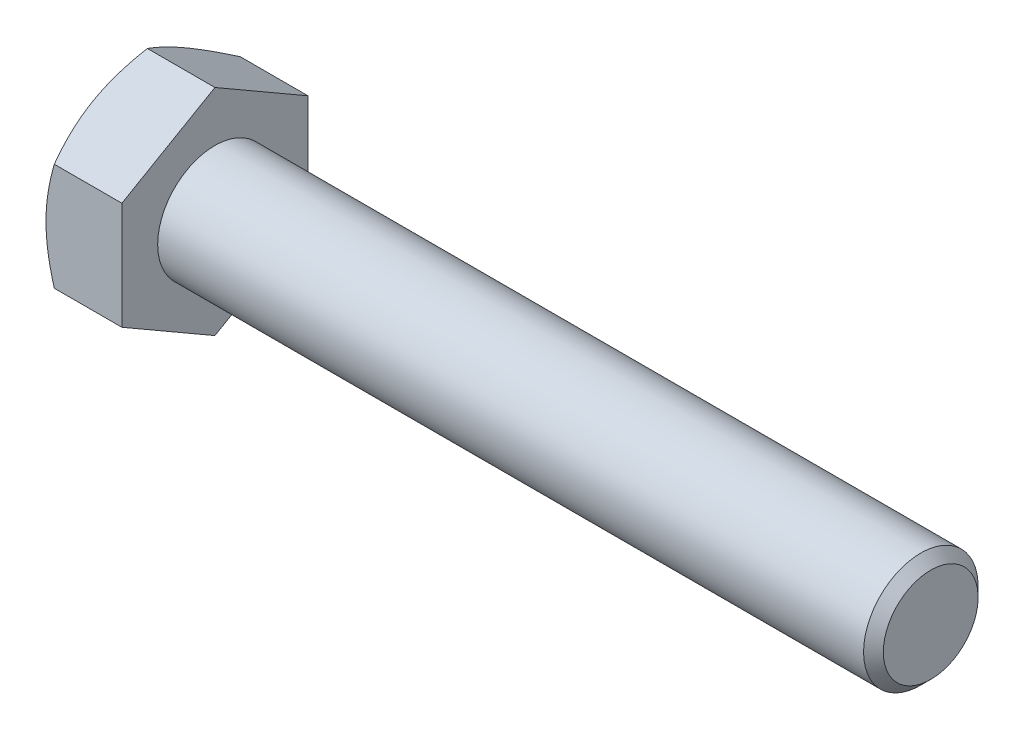
ISO-10303-21;
HEADER;
FILE_DESCRIPTION(('STEP AP214'),'2;1');
FILE_NAME('part.step','',(''),(''),'','','');
FILE_SCHEMA(('AUTOMOTIVE_DESIGN { 1 0 10303 214 1 1 1 1 }'));
ENDSEC;
DATA;
#1=APPLICATION_CONTEXT('core data for automotive mechanical design processes');
#2=APPLICATION_PROTOCOL_DEFINITION('international standard','automotive_design',2000,#1);
#3=PRODUCT_CONTEXT('',#1,'mechanical');
#4=PRODUCT('Part','Part','',(#3));
#5=PRODUCT_RELATED_PRODUCT_CATEGORY('part','',(#4));
#6=PRODUCT_DEFINITION_FORMATION('','',#4);
#7=PRODUCT_DEFINITION_CONTEXT('part definition',#1,'design');
#8=PRODUCT_DEFINITION('design','',#6,#7);
#9=PRODUCT_DEFINITION_SHAPE('','',#8);
#10=(LENGTH_UNIT() NAMED_UNIT(*) SI_UNIT(.MILLI.,.METRE.));
#11=(NAMED_UNIT(*) PLANE_ANGLE_UNIT() SI_UNIT($,.RADIAN.));
#12=(NAMED_UNIT(*) SI_UNIT($,.STERADIAN.) SOLID_ANGLE_UNIT());
#13=UNCERTAINTY_MEASURE_WITH_UNIT(LENGTH_MEASURE(1.E-05),#10,'distance_accuracy_value','');
#14=(GEOMETRIC_REPRESENTATION_CONTEXT(3) GLOBAL_UNCERTAINTY_ASSIGNED_CONTEXT((#13)) GLOBAL_UNIT_ASSIGNED_CONTEXT((#10,
#11,#12)) REPRESENTATION_CONTEXT('',''));
#15=CARTESIAN_POINT('',(0.,0.,0.));
#16=DIRECTION('',(0.,0.,1.));
#17=DIRECTION('',(1.,0.,0.));
#18=AXIS2_PLACEMENT_3D('',#15,#16,#17);
#19=CARTESIAN_POINT('',(0.,7.50555349946514,0.));
#20=DIRECTION('',(1.,0.,0.));
#21=DIRECTION('',(0.,0.,-1.));
#22=AXIS2_PLACEMENT_3D('',#19,#20,#21);
#23=PLANE('',#22);
#24=CARTESIAN_POINT('',(0.,0.,0.));
#25=DIRECTION('',(1.,0.,0.));
#26=DIRECTION('',(0.,0.,-1.));
#27=AXIS2_PLACEMENT_3D('',#24,#25,#26);
#28=CIRCLE('',#27,6.49999999995998);
#29=CARTESIAN_POINT('',(1.15555477460892E-11,-5.62916512458153,-3.24999999999));
#30=VERTEX_POINT('',#29);
#31=CARTESIAN_POINT('',(1.1552457738841E-11,0.,-6.49999999997999));
#32=VERTEX_POINT('',#31);
#33=EDGE_CURVE('E339',#30,#32,#28,.T.);
#34=ORIENTED_EDGE('',*,*,#33,.F.);
#35=CARTESIAN_POINT('',(0.,0.,0.));
#36=DIRECTION('',(1.,0.,0.));
#37=DIRECTION('',(0.,0.,-1.));
#38=AXIS2_PLACEMENT_3D('',#35,#36,#37);
#39=CIRCLE('',#38,6.49999999995998);
#40=CARTESIAN_POINT('',(1.15550411053332E-11,-5.62916512458152,3.24999999999001));
#41=VERTEX_POINT('',#40);
#42=EDGE_CURVE('E338',#41,#30,#39,.T.);
#43=ORIENTED_EDGE('',*,*,#42,.F.);
#44=CARTESIAN_POINT('',(0.,0.,0.));
#45=DIRECTION('',(1.,0.,0.));
#46=DIRECTION('',(0.,0.,-1.));
#47=AXIS2_PLACEMENT_3D('',#44,#45,#46);
#48=CIRCLE('',#47,6.49999999995998);
#49=CARTESIAN_POINT('',(1.15521679258111E-11,0.,6.49999999997999));
#50=VERTEX_POINT('',#49);
#51=EDGE_CURVE('E88',#50,#41,#48,.T.);
#52=ORIENTED_EDGE('',*,*,#51,.F.);
#53=CARTESIAN_POINT('',(0.,0.,0.));
#54=DIRECTION('',(1.,0.,0.));
#55=DIRECTION('',(0.,0.,-1.));
#56=AXIS2_PLACEMENT_3D('',#53,#54,#55);
#57=CIRCLE('',#56,6.49999999995998);
#58=CARTESIAN_POINT('',(1.15524765323843E-11,5.62916512458152,3.24999999999));
#59=VERTEX_POINT('',#58);
#60=EDGE_CURVE('E86',#59,#50,#57,.T.);
#61=ORIENTED_EDGE('',*,*,#60,.F.);
#62=CARTESIAN_POINT('',(0.,0.,0.));
#63=DIRECTION('',(1.,0.,0.));
#64=DIRECTION('',(0.,0.,-1.));
#65=AXIS2_PLACEMENT_3D('',#62,#63,#64);
#66=CIRCLE('',#65,6.49999999995998);
#67=CARTESIAN_POINT('',(1.15520344122427E-11,5.62916512458152,-3.24999999999));
#68=VERTEX_POINT('',#67);
#69=EDGE_CURVE('E19',#68,#59,#66,.T.);
#70=ORIENTED_EDGE('',*,*,#69,.F.);
#71=CARTESIAN_POINT('',(0.,0.,0.));
#72=DIRECTION('',(1.,0.,0.));
#73=DIRECTION('',(0.,0.,-1.));
#74=AXIS2_PLACEMENT_3D('',#71,#72,#73);
#75=CIRCLE('',#74,6.49999999995998);
#76=EDGE_CURVE('E264',#32,#68,#75,.T.);
#77=ORIENTED_EDGE('',*,*,#76,.F.);
#78=EDGE_LOOP('',(#34,#43,#52,#61,#70,#77));
#79=FACE_BOUND('',#78,.T.);
#80=ADVANCED_FACE('F16',(#79),#23,.F.);
#81=CARTESIAN_POINT('',(0.584039923126056,0.,0.));
#82=DIRECTION('',(1.,0.,0.));
#83=DIRECTION('',(0.,0.,-1.));
#84=AXIS2_PLACEMENT_3D('',#81,#82,#83);
#85=CONICAL_SURFACE('',#84,7.51158682049891,1.047197551212);
#86=CARTESIAN_POINT('',(0.580556583603038,7.50555349946481,-5.68456481556597E-13));
#87=CARTESIAN_POINT('',(0.492351589092373,7.35281628523265,-0.26454861525721));
#88=CARTESIAN_POINT('',(0.411540414604503,7.19885589650209,-0.531215830891591));
#89=CARTESIAN_POINT('',(0.269031363386546,6.88957797343578,-1.06690090730181));
#90=CARTESIAN_POINT('',(0.207238975555895,6.73427122699289,-1.33590008289911));
#91=CARTESIAN_POINT('',(0.131368414291871,6.49984538856281,-1.74193754566694));
#92=CARTESIAN_POINT('',(0.108872020464256,6.42140731241997,-1.8777962787943));
#93=CARTESIAN_POINT('',(0.0699302938009757,6.264155645091,-2.15016415618299));
#94=CARTESIAN_POINT('',(0.0534848017009781,6.18534206384378,-2.28667328322963));
#95=CARTESIAN_POINT('',(0.0269338255085263,6.02704786462284,-2.56084687882373));
#96=CARTESIAN_POINT('',(0.0168605830574699,5.94756588426557,-2.69851370708872));
#97=CARTESIAN_POINT('',(0.00337972763244669,5.78844560823805,-2.97411810968276));
#98=CARTESIAN_POINT('',(-2.65652346789022E-05,5.70880728473494,-3.11205573221976));
#99=CARTESIAN_POINT('',(2.31040688244853E-11,5.62916512459895,-3.24999999999983));
#100=B_SPLINE_CURVE_WITH_KNOTS('',3,(#86,#87,#88,#89,#90,#91,#92,#93,#94,#95,#96,#97,#98,#99),
.UNSPECIFIED.,.F.,.F.,(4,2,2,2,2,2,4),(0.,0.954247655906537,1.9036737621373,2.37900973801286,
2.85433320178906,3.332042816259,3.80984701130876),.UNSPECIFIED.);
#101=CARTESIAN_POINT('',(0.580556583603038,7.50555349946481,0.));
#102=VERTEX_POINT('',#101);
#103=EDGE_CURVE('E98',#102,#68,#100,.T.);
#104=ORIENTED_EDGE('',*,*,#103,.T.);
#105=ORIENTED_EDGE('',*,*,#69,.T.);
#106=CARTESIAN_POINT('',(2.38262969880455E-11,5.62916512459777,3.24999999999938));
#107=CARTESIAN_POINT('',(-2.65652344219582E-05,5.70880728473446,3.11205573221969));
#108=CARTESIAN_POINT('',(0.00337972763251203,5.78844560823787,2.97411810968284));
#109=CARTESIAN_POINT('',(0.016860583057394,5.94756588426561,2.69851370708889));
#110=CARTESIAN_POINT('',(0.0269338255085004,6.02704786462282,2.56084687882384));
#111=CARTESIAN_POINT('',(0.0534848017009882,6.18534206384371,2.28667328322969));
#112=CARTESIAN_POINT('',(0.0699302938009718,6.26415564509096,2.15016415618305));
#113=CARTESIAN_POINT('',(0.108872020464242,6.42140731241995,1.87779627879436));
#114=CARTESIAN_POINT('',(0.131368414291862,6.49984538856279,1.74193754566698));
#115=CARTESIAN_POINT('',(0.207238975555892,6.73427122699287,1.33590008289914));
#116=CARTESIAN_POINT('',(0.269031363386541,6.88957797343576,1.06690090730184));
#117=CARTESIAN_POINT('',(0.411540414604495,7.19885589650208,0.531215830891611));
#118=CARTESIAN_POINT('',(0.492351589092366,7.35281628523265,0.264548615257222));
#119=CARTESIAN_POINT('',(0.580556583603039,7.50555349946481,5.67774003086218E-13));
#120=B_SPLINE_CURVE_WITH_KNOTS('',3,(#106,#107,#108,#109,#110,#111,#112,#113,#114,#115,#116,
#117,#118,#119),.UNSPECIFIED.,.F.,.F.,(4,2,2,2,2,2,4),(0.,0.477804195049821,0.955513809519796,
1.43083727329602,1.90617324917161,2.85559935540238,3.80984701130895),.UNSPECIFIED.);
#121=EDGE_CURVE('E96',#59,#102,#120,.T.);
#122=ORIENTED_EDGE('',*,*,#121,.T.);
#123=EDGE_LOOP('',(#104,#105,#122));
#124=FACE_BOUND('',#123,.T.);
#125=ADVANCED_FACE('F94',(#124),#85,.T.);
#126=CARTESIAN_POINT('',(0.584039923126056,0.,0.));
#127=DIRECTION('',(1.,0.,0.));
#128=DIRECTION('',(0.,0.,-1.));
#129=AXIS2_PLACEMENT_3D('',#126,#127,#128);
#130=CONICAL_SURFACE('',#129,7.51158682049891,1.047197551212);
#131=CARTESIAN_POINT('',(0.580556583603035,3.75277674973289,6.49999999999943));
#132=CARTESIAN_POINT('',(0.49235158909237,3.90551396396506,6.23545138474279));
#133=CARTESIAN_POINT('',(0.411540414604501,4.05947435269561,5.96878416910841));
#134=CARTESIAN_POINT('',(0.269031363386546,4.36875227576192,5.4330990926982));
#135=CARTESIAN_POINT('',(0.207238975555895,4.5240590222048,5.1640999171009));
#136=CARTESIAN_POINT('',(0.131368414291871,4.75848486063488,4.75806245433307));
#137=CARTESIAN_POINT('',(0.108872020464256,4.83692293677773,4.62220372120571));
#138=CARTESIAN_POINT('',(0.0699302938009757,4.99417460410669,4.34983584381702));
#139=CARTESIAN_POINT('',(0.0534848017009788,5.07298818535391,4.21332671677038));
#140=CARTESIAN_POINT('',(0.0269338255085272,5.23128238457485,3.93915312117628));
#141=CARTESIAN_POINT('',(0.0168605830574704,5.31076436493213,3.80148629291129));
#142=CARTESIAN_POINT('',(0.00337972763244649,5.46988464095964,3.52588189031725));
#143=CARTESIAN_POINT('',(-2.6565234679261E-05,5.54952296446275,3.38794426778026));
#144=CARTESIAN_POINT('',(2.31044109636824E-11,5.62916512459874,3.25000000000019));
#145=B_SPLINE_CURVE_WITH_KNOTS('',3,(#131,#132,#133,#134,#135,#136,#137,#138,#139,#140,#141,
#142,#143,#144),.UNSPECIFIED.,.F.,.F.,(4,2,2,2,2,2,4),(0.,0.954247655906532,1.90367376213729,
2.37900973801285,2.85433320178905,3.33204281625899,3.80984701130875),.UNSPECIFIED.);
#146=CARTESIAN_POINT('',(0.580556583603035,3.7527767497324,6.49999999999972));
#147=VERTEX_POINT('',#146);
#148=EDGE_CURVE('E101',#147,#59,#145,.T.);
#149=ORIENTED_EDGE('',*,*,#148,.T.);
#150=ORIENTED_EDGE('',*,*,#60,.T.);
#151=CARTESIAN_POINT('',(2.38266512998069E-11,0.,6.49999999999875));
#152=CARTESIAN_POINT('',(-2.65652344227332E-05,0.159284320272008,6.49999999999955));
#153=CARTESIAN_POINT('',(0.0033797276325113,0.31856096727825,6.49999999999988));
#154=CARTESIAN_POINT('',(0.0168605830573939,0.636801519333313,6.50000000000012));
#155=CARTESIAN_POINT('',(0.0269338255085009,0.795765480047878,6.50000000000003));
#156=CARTESIAN_POINT('',(0.0534848017009887,1.11235387848978,6.49999999999997));
#157=CARTESIAN_POINT('',(0.0699302938009717,1.26998104098423,6.49999999999999));
#158=CARTESIAN_POINT('',(0.108872020464242,1.58448437564217,6.50000000000001));
#159=CARTESIAN_POINT('',(0.131368414291861,1.74136052792787,6.5));
#160=CARTESIAN_POINT('',(0.207238975555891,2.21021220478804,6.49999999999999));
#161=CARTESIAN_POINT('',(0.26903136338654,2.52082569767382,6.5));
#162=CARTESIAN_POINT('',(0.411540414604493,3.13938154380644,6.5));
#163=CARTESIAN_POINT('',(0.492351589092363,3.44730232126757,6.50000000000001));
#164=CARTESIAN_POINT('',(0.580556583603035,3.75277674973191,6.5));
#165=B_SPLINE_CURVE_WITH_KNOTS('',3,(#151,#152,#153,#154,#155,#156,#157,#158,#159,#160,#161,
#162,#163,#164),.UNSPECIFIED.,.F.,.F.,(4,2,2,2,2,2,4),(0.,0.477804195049819,0.955513809519793,
1.43083727329602,1.90617324917161,2.85559935540237,3.80984701130894),.UNSPECIFIED.);
#166=EDGE_CURVE('E104',#50,#147,#165,.T.);
#167=ORIENTED_EDGE('',*,*,#166,.T.);
#168=EDGE_LOOP('',(#149,#150,#167));
#169=FACE_BOUND('',#168,.T.);
#170=ADVANCED_FACE('F102',(#169),#130,.T.);
#171=CARTESIAN_POINT('',(0.584039923126056,0.,0.));
#172=DIRECTION('',(1.,0.,0.));
#173=DIRECTION('',(0.,0.,-1.));
#174=AXIS2_PLACEMENT_3D('',#171,#172,#173);
#175=CONICAL_SURFACE('',#174,7.51158682049891,1.047197551212);
#176=ORIENTED_EDGE('',*,*,#51,.T.);
#177=CARTESIAN_POINT('',(2.38331262092634E-11,-5.62916512459777,3.24999999999939));
#178=CARTESIAN_POINT('',(-2.65652344164461E-05,-5.54952296446246,3.38794426777988));
#179=CARTESIAN_POINT('',(0.0033797276325173,-5.46988464095963,3.52588189031706));
#180=CARTESIAN_POINT('',(0.0168605830573994,-5.3107643649323,3.80148629291125));
#181=CARTESIAN_POINT('',(0.0269338255085061,-5.23128238457494,3.93915312117621));
#182=CARTESIAN_POINT('',(0.0534848017009937,-5.07298818535394,4.21332671677029));
#183=CARTESIAN_POINT('',(0.0699302938009766,-4.99417460410673,4.34983584381695));
#184=CARTESIAN_POINT('',(0.108872020464246,-4.83692293677778,4.62220372120566));
#185=CARTESIAN_POINT('',(0.131368414291866,-4.75848486063492,4.75806245433303));
#186=CARTESIAN_POINT('',(0.207238975555896,-4.52405902220483,5.16409991710086));
#187=CARTESIAN_POINT('',(0.269031363386544,-4.36875227576194,5.43309909269816));
#188=CARTESIAN_POINT('',(0.411540414604496,-4.05947435269564,5.96878416910839));
#189=CARTESIAN_POINT('',(0.492351589092366,-3.90551396396508,6.23545138474278));
#190=CARTESIAN_POINT('',(0.580556583603037,-3.7527767497329,6.49999999999943));
#191=B_SPLINE_CURVE_WITH_KNOTS('',3,(#177,#178,#179,#180,#181,#182,#183,#184,#185,#186,#187,
#188,#189,#190),.UNSPECIFIED.,.F.,.F.,(4,2,2,2,2,2,4),(0.,0.477804195049818,0.955513809519791,
1.43083727329601,1.9061732491716,2.85559935540236,3.80984701130893),.UNSPECIFIED.);
#192=CARTESIAN_POINT('',(0.580556583603037,-3.75277674973241,6.49999999999971));
#193=VERTEX_POINT('',#192);
#194=EDGE_CURVE('E179',#41,#193,#191,.T.);
#195=ORIENTED_EDGE('',*,*,#194,.T.);
#196=CARTESIAN_POINT('',(0.580556583603038,-3.75277674973192,6.5));
#197=CARTESIAN_POINT('',(0.492351589092373,-3.44730232126759,6.5));
#198=CARTESIAN_POINT('',(0.411540414604503,-3.13938154380647,6.5));
#199=CARTESIAN_POINT('',(0.269031363386547,-2.52082569767387,6.5));
#200=CARTESIAN_POINT('',(0.207238975555896,-2.21021220478809,6.5));
#201=CARTESIAN_POINT('',(0.131368414291872,-1.74136052792793,6.5));
#202=CARTESIAN_POINT('',(0.108872020464256,-1.58448437564224,6.5));
#203=CARTESIAN_POINT('',(0.069930293800976,-1.26998104098431,6.5));
#204=CARTESIAN_POINT('',(0.0534848017009787,-1.11235387848987,6.5));
#205=CARTESIAN_POINT('',(0.026933825508527,-0.795765480047989,6.5));
#206=CARTESIAN_POINT('',(0.0168605830574705,-0.636801519333436,6.5));
#207=CARTESIAN_POINT('',(0.00337972763244701,-0.318560967278408,6.5));
#208=CARTESIAN_POINT('',(-2.65652346786707E-05,-0.159284320272188,6.5));
#209=CARTESIAN_POINT('',(2.31044610445054E-11,-2.08059797367535E-13,6.5));
#210=B_SPLINE_CURVE_WITH_KNOTS('',3,(#196,#197,#198,#199,#200,#201,#202,#203,#204,#205,#206,
#207,#208,#209),.UNSPECIFIED.,.F.,.F.,(4,2,2,2,2,2,4),(0.,0.954247655906535,1.9036737621373,
2.37900973801286,2.85433320178906,3.33204281625899,3.80984701130876),.UNSPECIFIED.);
#211=EDGE_CURVE('E151',#193,#50,#210,.T.);
#212=ORIENTED_EDGE('',*,*,#211,.T.);
#213=EDGE_LOOP('',(#176,#195,#212));
#214=FACE_BOUND('',#213,.T.);
#215=ADVANCED_FACE('F141',(#214),#175,.T.);
#216=CARTESIAN_POINT('',(0.584039923126056,0.,0.));
#217=DIRECTION('',(1.,0.,0.));
#218=DIRECTION('',(0.,0.,-1.));
#219=AXIS2_PLACEMENT_3D('',#216,#217,#218);
#220=CONICAL_SURFACE('',#219,7.51158682049891,1.047197551212);
#221=ORIENTED_EDGE('',*,*,#42,.T.);
#222=CARTESIAN_POINT('',(2.38342887376555E-11,-5.62916512459777,-3.24999999999938));
#223=CARTESIAN_POINT('',(-2.65652344147577E-05,-5.70880728473447,-3.11205573221969));
#224=CARTESIAN_POINT('',(0.00337972763251886,-5.78844560823788,-2.97411810968284));
#225=CARTESIAN_POINT('',(0.0168605830574005,-5.94756588426562,-2.69851370708889));
#226=CARTESIAN_POINT('',(0.0269338255085069,-6.02704786462283,-2.56084687882384));
#227=CARTESIAN_POINT('',(0.0534848017009949,-6.18534206384372,-2.2866732832297));
#228=CARTESIAN_POINT('',(0.0699302938009785,-6.26415564509097,-2.15016415618305));
#229=CARTESIAN_POINT('',(0.108872020464249,-6.42140731241996,-1.87779627879436));
#230=CARTESIAN_POINT('',(0.131368414291869,-6.4998453885628,-1.74193754566699));
#231=CARTESIAN_POINT('',(0.207238975555899,-6.73427122699288,-1.33590008289914));
#232=CARTESIAN_POINT('',(0.269031363386548,-6.88957797343577,-1.06690090730184));
#233=CARTESIAN_POINT('',(0.411540414604502,-7.19885589650209,-0.531215830891612));
#234=CARTESIAN_POINT('',(0.492351589092373,-7.35281628523266,-0.264548615257222));
#235=CARTESIAN_POINT('',(0.580556583603045,-7.50555349946482,-5.67704371195565E-13));
#236=B_SPLINE_CURVE_WITH_KNOTS('',3,(#222,#223,#224,#225,#226,#227,#228,#229,#230,#231,#232,
#233,#234,#235),.UNSPECIFIED.,.F.,.F.,(4,2,2,2,2,2,4),(0.,0.47780419504982,0.955513809519797,
1.43083727329602,1.90617324917161,2.85559935540238,3.80984701130896),.UNSPECIFIED.);
#237=CARTESIAN_POINT('',(0.580556583603045,-7.50555349946482,0.));
#238=VERTEX_POINT('',#237);
#239=EDGE_CURVE('E311',#30,#238,#236,.T.);
#240=ORIENTED_EDGE('',*,*,#239,.T.);
#241=CARTESIAN_POINT('',(0.580556583603045,-7.50555349946482,5.69366376944182E-13));
#242=CARTESIAN_POINT('',(0.492351589092379,-7.35281628523266,0.264548615257211));
#243=CARTESIAN_POINT('',(0.411540414604509,-7.1988558965021,0.531215830891592));
#244=CARTESIAN_POINT('',(0.269031363386554,-6.8895779734358,1.06690090730181));
#245=CARTESIAN_POINT('',(0.207238975555903,-6.73427122699291,1.33590008289911));
#246=CARTESIAN_POINT('',(0.131368414291878,-6.49984538856283,1.74193754566694));
#247=CARTESIAN_POINT('',(0.108872020464262,-6.42140731241998,1.8777962787943));
#248=CARTESIAN_POINT('',(0.0699302938009814,-6.26415564509101,2.15016415618299));
#249=CARTESIAN_POINT('',(0.0534848017009844,-6.18534206384379,2.28667328322964));
#250=CARTESIAN_POINT('',(0.0269338255085328,-6.02704786462285,2.56084687882373));
#251=CARTESIAN_POINT('',(0.0168605830574762,-5.94756588426558,2.69851370708873));
#252=CARTESIAN_POINT('',(0.00337972763245243,-5.78844560823806,2.97411810968276));
#253=CARTESIAN_POINT('',(-2.65652346733646E-05,-5.70880728473495,3.11205573221976));
#254=CARTESIAN_POINT('',(2.31099570177832E-11,-5.62916512459896,3.24999999999983));
#255=B_SPLINE_CURVE_WITH_KNOTS('',3,(#241,#242,#243,#244,#245,#246,#247,#248,#249,#250,#251,
#252,#253,#254),.UNSPECIFIED.,.F.,.F.,(4,2,2,2,2,2,4),(0.,0.954247655906537,1.9036737621373,
2.37900973801286,2.85433320178906,3.332042816259,3.80984701130877),.UNSPECIFIED.);
#256=EDGE_CURVE('E173',#238,#41,#255,.T.);
#257=ORIENTED_EDGE('',*,*,#256,.T.);
#258=EDGE_LOOP('',(#221,#240,#257));
#259=FACE_BOUND('',#258,.T.);
#260=ADVANCED_FACE('F329',(#259),#220,.T.);
#261=CARTESIAN_POINT('',(0.584039923126056,0.,0.));
#262=DIRECTION('',(1.,0.,0.));
#263=DIRECTION('',(0.,0.,-1.));
#264=AXIS2_PLACEMENT_3D('',#261,#262,#263);
#265=CONICAL_SURFACE('',#264,7.51158682049891,1.047197551212);
#266=ORIENTED_EDGE('',*,*,#33,.T.);
#267=CARTESIAN_POINT('',(2.38274285891329E-11,0.,-6.49999999999875));
#268=CARTESIAN_POINT('',(-2.6565234421441E-05,-0.159284320272008,-6.49999999999955));
#269=CARTESIAN_POINT('',(0.00337972763251244,-0.318560967278251,-6.49999999999988));
#270=CARTESIAN_POINT('',(0.0168605830573945,-0.636801519333316,-6.50000000000012));
#271=CARTESIAN_POINT('',(0.0269338255085012,-0.795765480047881,-6.50000000000003));
#272=CARTESIAN_POINT('',(0.0534848017009894,-1.11235387848978,-6.49999999999997));
#273=CARTESIAN_POINT('',(0.069930293800973,-1.26998104098423,-6.49999999999999));
#274=CARTESIAN_POINT('',(0.108872020464243,-1.58448437564218,-6.50000000000001));
#275=CARTESIAN_POINT('',(0.131368414291863,-1.74136052792788,-6.50000000000001));
#276=CARTESIAN_POINT('',(0.207238975555893,-2.21021220478805,-6.5));
#277=CARTESIAN_POINT('',(0.269031363386542,-2.52082569767383,-6.5));
#278=CARTESIAN_POINT('',(0.411540414604496,-3.13938154380645,-6.50000000000001));
#279=CARTESIAN_POINT('',(0.492351589092367,-3.44730232126758,-6.50000000000001));
#280=CARTESIAN_POINT('',(0.580556583603039,-3.75277674973192,-6.5));
#281=B_SPLINE_CURVE_WITH_KNOTS('',3,(#267,#268,#269,#270,#271,#272,#273,#274,#275,#276,#277,
#278,#279,#280),.UNSPECIFIED.,.F.,.F.,(4,2,2,2,2,2,4),(0.,0.477804195049821,0.955513809519797,
1.43083727329602,1.90617324917161,2.85559935540238,3.80984701130895),.UNSPECIFIED.);
#282=CARTESIAN_POINT('',(0.580556583603039,-3.75277674973241,-6.49999999999972));
#283=VERTEX_POINT('',#282);
#284=EDGE_CURVE('E240',#32,#283,#281,.T.);
#285=ORIENTED_EDGE('',*,*,#284,.T.);
#286=CARTESIAN_POINT('',(0.580556583603039,-3.75277674973291,-6.49999999999943));
#287=CARTESIAN_POINT('',(0.492351589092374,-3.90551396396507,-6.23545138474279));
#288=CARTESIAN_POINT('',(0.411540414604505,-4.05947435269563,-5.96878416910841));
#289=CARTESIAN_POINT('',(0.269031363386551,-4.36875227576193,-5.4330990926982));
#290=CARTESIAN_POINT('',(0.2072389755559,-4.52405902220482,-5.1640999171009));
#291=CARTESIAN_POINT('',(0.131368414291877,-4.7584848606349,-4.75806245433307));
#292=CARTESIAN_POINT('',(0.108872020464262,-4.83692293677774,-4.62220372120571));
#293=CARTESIAN_POINT('',(0.0699302938009821,-4.9941746041067,-4.34983584381703));
#294=CARTESIAN_POINT('',(0.0534848017009851,-5.07298818535393,-4.21332671677038));
#295=CARTESIAN_POINT('',(0.0269338255085335,-5.23128238457487,-3.93915312117628));
#296=CARTESIAN_POINT('',(0.0168605830574768,-5.31076436493214,-3.80148629291129));
#297=CARTESIAN_POINT('',(0.00337972763245304,-5.46988464095966,-3.52588189031725));
#298=CARTESIAN_POINT('',(-2.65652346726809E-05,-5.54952296446277,-3.38794426778026));
#299=CARTESIAN_POINT('',(2.3110845106412E-11,-5.62916512459875,-3.25000000000019));
#300=B_SPLINE_CURVE_WITH_KNOTS('',3,(#286,#287,#288,#289,#290,#291,#292,#293,#294,#295,#296,
#297,#298,#299),.UNSPECIFIED.,.F.,.F.,(4,2,2,2,2,2,4),(0.,0.954247655906531,1.90367376213729,
2.37900973801285,2.85433320178905,3.33204281625898,3.80984701130874),.UNSPECIFIED.);
#301=EDGE_CURVE('E310',#283,#30,#300,.T.);
#302=ORIENTED_EDGE('',*,*,#301,.T.);
#303=EDGE_LOOP('',(#266,#285,#302));
#304=FACE_BOUND('',#303,.T.);
#305=ADVANCED_FACE('F255',(#304),#265,.T.);
#306=CARTESIAN_POINT('',(0.584039923126056,0.,0.));
#307=DIRECTION('',(1.,0.,0.));
#308=DIRECTION('',(0.,0.,-1.));
#309=AXIS2_PLACEMENT_3D('',#306,#307,#308);
#310=CONICAL_SURFACE('',#309,7.51158682049891,1.047197551212);
#311=CARTESIAN_POINT('',(0.580556583603034,3.7527767497319,-6.5));
#312=CARTESIAN_POINT('',(0.49235158909237,3.44730232126758,-6.5));
#313=CARTESIAN_POINT('',(0.4115404146045,3.13938154380646,-6.5));
#314=CARTESIAN_POINT('',(0.269031363386546,2.52082569767386,-6.5));
#315=CARTESIAN_POINT('',(0.207238975555895,2.21021220478808,-6.5));
#316=CARTESIAN_POINT('',(0.131368414291872,1.74136052792792,-6.5));
#317=CARTESIAN_POINT('',(0.108872020464256,1.58448437564224,-6.5));
#318=CARTESIAN_POINT('',(0.069930293800976,1.26998104098431,-6.5));
#319=CARTESIAN_POINT('',(0.0534848017009787,1.11235387848986,-6.5));
#320=CARTESIAN_POINT('',(0.0269338255085272,0.795765480047986,-6.5));
#321=CARTESIAN_POINT('',(0.016860583057471,0.636801519333434,-6.5));
#322=CARTESIAN_POINT('',(0.00337972763244778,0.318560967278407,-6.5));
#323=CARTESIAN_POINT('',(-2.65652346778902E-05,0.159284320272187,-6.5));
#324=CARTESIAN_POINT('',(2.3104915477682E-11,2.07807434490731E-13,-6.5));
#325=B_SPLINE_CURVE_WITH_KNOTS('',3,(#311,#312,#313,#314,#315,#316,#317,#318,#319,#320,#321,
#322,#323,#324),.UNSPECIFIED.,.F.,.F.,(4,2,2,2,2,2,4),(0.,0.954247655906532,1.90367376213729,
2.37900973801285,2.85433320178905,3.33204281625898,3.80984701130874),.UNSPECIFIED.);
#326=CARTESIAN_POINT('',(0.580556583603129,3.75277674973273,-6.49999999999972));
#327=VERTEX_POINT('',#326);
#328=EDGE_CURVE('E231',#327,#32,#325,.T.);
#329=ORIENTED_EDGE('',*,*,#328,.T.);
#330=ORIENTED_EDGE('',*,*,#76,.T.);
#331=CARTESIAN_POINT('',(2.38257762237078E-11,5.62916512459776,-3.24999999999938));
#332=CARTESIAN_POINT('',(-2.65652344229916E-05,5.54952296446245,-3.38794426777988));
#333=CARTESIAN_POINT('',(0.00337972763251109,5.46988464095962,-3.52588189031706));
#334=CARTESIAN_POINT('',(0.0168605830573934,5.31076436493229,-3.80148629291124));
#335=CARTESIAN_POINT('',(0.0269338255085001,5.23128238457493,-3.9391531211762));
#336=CARTESIAN_POINT('',(0.0534848017009878,5.07298818535393,-4.21332671677028));
#337=CARTESIAN_POINT('',(0.069930293800971,4.99417460410672,-4.34983584381695));
#338=CARTESIAN_POINT('',(0.108872020464241,4.83692293677777,-4.62220372120566));
#339=CARTESIAN_POINT('',(0.131368414291861,4.75848486063491,-4.75806245433303));
#340=CARTESIAN_POINT('',(0.207238975555891,4.52405902220482,-5.16409991710086));
#341=CARTESIAN_POINT('',(0.269031363386539,4.36875227576193,-5.43309909269817));
#342=CARTESIAN_POINT('',(0.411540414604492,4.05947435269563,-5.9687841691084));
#343=CARTESIAN_POINT('',(0.492351589092362,3.90551396396506,-6.23545138474279));
#344=CARTESIAN_POINT('',(0.580556583603035,3.75277674973289,-6.49999999999943));
#345=B_SPLINE_CURVE_WITH_KNOTS('',3,(#331,#332,#333,#334,#335,#336,#337,#338,#339,#340,#341,
#342,#343,#344),.UNSPECIFIED.,.F.,.F.,(4,2,2,2,2,2,4),(0.,0.477804195049819,0.955513809519792,
1.43083727329602,1.90617324917161,2.85559935540237,3.80984701130894),.UNSPECIFIED.);
#346=EDGE_CURVE('E114',#68,#327,#345,.T.);
#347=ORIENTED_EDGE('',*,*,#346,.T.);
#348=EDGE_LOOP('',(#329,#330,#347));
#349=FACE_BOUND('',#348,.T.);
#350=ADVANCED_FACE('F250',(#349),#310,.T.);
#351=CARTESIAN_POINT('',(55.3,0.,0.));
#352=DIRECTION('',(-1.,0.,0.));
#353=DIRECTION('',(0.,0.,1.));
#354=AXIS2_PLACEMENT_3D('',#351,#352,#353);
#355=PLANE('',#354);
#356=CARTESIAN_POINT('',(55.2999999999315,0.,0.));
#357=DIRECTION('',(-1.,0.,0.));
#358=DIRECTION('',(0.,0.,1.));
#359=AXIS2_PLACEMENT_3D('',#356,#357,#358);
#360=CIRCLE('',#359,3.3095000000003);
#361=CARTESIAN_POINT('',(55.2999999999315,0.,3.3095000000003));
#362=VERTEX_POINT('',#361);
#363=EDGE_CURVE('E202',#362,#362,#360,.T.);
#364=ORIENTED_EDGE('',*,*,#363,.F.);
#365=EDGE_LOOP('',(#364));
#366=FACE_BOUND('',#365,.T.);
#367=ADVANCED_FACE('F254',(#366),#355,.F.);
#368=CARTESIAN_POINT('',(5.3,3.75277674973256,-6.5));
#369=DIRECTION('',(0.,-0.866025403784438,0.500000000000001));
#370=DIRECTION('',(0.,-0.500000000000001,-0.866025403784438));
#371=AXIS2_PLACEMENT_3D('',#368,#369,#370);
#372=PLANE('',#371);
#373=DIRECTION('',(1.,0.,0.));
#374=VECTOR('',#373,1.);
#375=CARTESIAN_POINT('',(5.3,7.50555349946514,0.));
#376=LINE('',#375,#374);
#377=CARTESIAN_POINT('',(5.3,7.50555349946514,0.));
#378=VERTEX_POINT('',#377);
#379=EDGE_CURVE('E107',#102,#378,#376,.T.);
#380=ORIENTED_EDGE('',*,*,#379,.T.);
#381=DIRECTION('',(0.,0.500000000000001,0.866025403784438));
#382=VECTOR('',#381,1.);
#383=CARTESIAN_POINT('',(5.3,3.75277674973256,-6.5));
#384=LINE('',#383,#382);
#385=CARTESIAN_POINT('',(5.3,3.75277674973256,-6.5));
#386=VERTEX_POINT('',#385);
#387=EDGE_CURVE('E198',#386,#378,#384,.T.);
#388=ORIENTED_EDGE('',*,*,#387,.F.);
#389=DIRECTION('',(1.,0.,0.));
#390=VECTOR('',#389,1.);
#391=CARTESIAN_POINT('',(5.3,3.75277674973256,-6.5));
#392=LINE('',#391,#390);
#393=EDGE_CURVE('E239',#386,#327,#392,.F.);
#394=ORIENTED_EDGE('',*,*,#393,.T.);
#395=ORIENTED_EDGE('',*,*,#346,.F.);
#396=ORIENTED_EDGE('',*,*,#103,.F.);
#397=EDGE_LOOP('',(#380,#388,#394,#395,#396));
#398=FACE_BOUND('',#397,.T.);
#399=ADVANCED_FACE('F266',(#398),#372,.F.);
#400=CARTESIAN_POINT('',(5.3,7.50555349946514,0.));
#401=DIRECTION('',(0.,-0.866025403784438,-0.500000000000001));
#402=DIRECTION('',(0.,0.500000000000001,-0.866025403784438));
#403=AXIS2_PLACEMENT_3D('',#400,#401,#402);
#404=PLANE('',#403);
#405=DIRECTION('',(1.,0.,0.));
#406=VECTOR('',#405,1.);
#407=CARTESIAN_POINT('',(5.3,3.75277674973256,6.5));
#408=LINE('',#407,#406);
#409=CARTESIAN_POINT('',(5.3,3.75277674973256,6.5));
#410=VERTEX_POINT('',#409);
#411=EDGE_CURVE('E150',#147,#410,#408,.T.);
#412=ORIENTED_EDGE('',*,*,#411,.T.);
#413=DIRECTION('',(0.,-0.500000000000001,0.866025403784438));
#414=VECTOR('',#413,1.);
#415=CARTESIAN_POINT('',(5.3,7.50555349946514,0.));
#416=LINE('',#415,#414);
#417=EDGE_CURVE('E201',#378,#410,#416,.T.);
#418=ORIENTED_EDGE('',*,*,#417,.F.);
#419=ORIENTED_EDGE('',*,*,#379,.F.);
#420=ORIENTED_EDGE('',*,*,#121,.F.);
#421=ORIENTED_EDGE('',*,*,#148,.F.);
#422=EDGE_LOOP('',(#412,#418,#419,#420,#421));
#423=FACE_BOUND('',#422,.T.);
#424=ADVANCED_FACE('F110',(#423),#404,.F.);
#425=CARTESIAN_POINT('',(5.3,3.75277674973256,6.5));
#426=DIRECTION('',(0.,0.,-1.));
#427=DIRECTION('',(0.,1.,0.));
#428=AXIS2_PLACEMENT_3D('',#425,#426,#427);
#429=PLANE('',#428);
#430=DIRECTION('',(1.,0.,0.));
#431=VECTOR('',#430,1.);
#432=CARTESIAN_POINT('',(5.3,-3.75277674973258,6.5));
#433=LINE('',#432,#431);
#434=CARTESIAN_POINT('',(5.3,-3.75277674973257,6.5));
#435=VERTEX_POINT('',#434);
#436=EDGE_CURVE('E184',#193,#435,#433,.T.);
#437=ORIENTED_EDGE('',*,*,#436,.T.);
#438=DIRECTION('',(0.,1.,0.));
#439=VECTOR('',#438,1.);
#440=CARTESIAN_POINT('',(5.3,7.50555349946514,6.5));
#441=LINE('',#440,#439);
#442=EDGE_CURVE('E218',#410,#435,#441,.F.);
#443=ORIENTED_EDGE('',*,*,#442,.F.);
#444=ORIENTED_EDGE('',*,*,#411,.F.);
#445=ORIENTED_EDGE('',*,*,#166,.F.);
#446=ORIENTED_EDGE('',*,*,#211,.F.);
#447=EDGE_LOOP('',(#437,#443,#444,#445,#446));
#448=FACE_BOUND('',#447,.T.);
#449=ADVANCED_FACE('F157',(#448),#429,.F.);
#450=CARTESIAN_POINT('',(5.3,-7.50555349946515,0.));
#451=DIRECTION('',(0.,0.866025403784438,-0.500000000000001));
#452=DIRECTION('',(0.,0.500000000000001,0.866025403784438));
#453=AXIS2_PLACEMENT_3D('',#450,#451,#452);
#454=PLANE('',#453);
#455=DIRECTION('',(1.,0.,0.));
#456=VECTOR('',#455,1.);
#457=CARTESIAN_POINT('',(5.3,-7.50555349946515,0.));
#458=LINE('',#457,#456);
#459=CARTESIAN_POINT('',(5.3,-7.50555349946515,0.));
#460=VERTEX_POINT('',#459);
#461=EDGE_CURVE('E308',#238,#460,#458,.T.);
#462=ORIENTED_EDGE('',*,*,#461,.T.);
#463=DIRECTION('',(0.,-0.500000000000001,-0.866025403784438));
#464=VECTOR('',#463,1.);
#465=CARTESIAN_POINT('',(5.3,-3.75277674973257,6.5));
#466=LINE('',#465,#464);
#467=EDGE_CURVE('E213',#435,#460,#466,.T.);
#468=ORIENTED_EDGE('',*,*,#467,.F.);
#469=ORIENTED_EDGE('',*,*,#436,.F.);
#470=ORIENTED_EDGE('',*,*,#194,.F.);
#471=ORIENTED_EDGE('',*,*,#256,.F.);
#472=EDGE_LOOP('',(#462,#468,#469,#470,#471));
#473=FACE_BOUND('',#472,.T.);
#474=ADVANCED_FACE('F161',(#473),#454,.F.);
#475=CARTESIAN_POINT('',(5.3,-3.75277674973258,-6.5));
#476=DIRECTION('',(0.,0.866025403784438,0.500000000000001));
#477=DIRECTION('',(0.,-0.500000000000001,0.866025403784438));
#478=AXIS2_PLACEMENT_3D('',#475,#476,#477);
#479=PLANE('',#478);
#480=DIRECTION('',(1.,0.,0.));
#481=VECTOR('',#480,1.);
#482=CARTESIAN_POINT('',(5.3,-3.75277674973258,-6.5));
#483=LINE('',#482,#481);
#484=CARTESIAN_POINT('',(5.3,-3.75277674973258,-6.5));
#485=VERTEX_POINT('',#484);
#486=EDGE_CURVE('E34',#283,#485,#483,.T.);
#487=ORIENTED_EDGE('',*,*,#486,.T.);
#488=DIRECTION('',(0.,0.500000000000001,-0.866025403784438));
#489=VECTOR('',#488,1.);
#490=CARTESIAN_POINT('',(5.3,-7.50555349946515,0.));
#491=LINE('',#490,#489);
#492=EDGE_CURVE('E208',#460,#485,#491,.T.);
#493=ORIENTED_EDGE('',*,*,#492,.F.);
#494=ORIENTED_EDGE('',*,*,#461,.F.);
#495=ORIENTED_EDGE('',*,*,#239,.F.);
#496=ORIENTED_EDGE('',*,*,#301,.F.);
#497=EDGE_LOOP('',(#487,#493,#494,#495,#496));
#498=FACE_BOUND('',#497,.T.);
#499=ADVANCED_FACE('F167',(#498),#479,.F.);
#500=CARTESIAN_POINT('',(5.3,3.75277674973256,-6.5));
#501=DIRECTION('',(0.,0.,1.));
#502=DIRECTION('',(0.,-1.,0.));
#503=AXIS2_PLACEMENT_3D('',#500,#501,#502);
#504=PLANE('',#503);
#505=ORIENTED_EDGE('',*,*,#393,.F.);
#506=DIRECTION('',(0.,1.,0.));
#507=VECTOR('',#506,1.);
#508=CARTESIAN_POINT('',(5.3,7.50555349946514,-6.5));
#509=LINE('',#508,#507);
#510=EDGE_CURVE('E205',#485,#386,#509,.T.);
#511=ORIENTED_EDGE('',*,*,#510,.F.);
#512=ORIENTED_EDGE('',*,*,#486,.F.);
#513=ORIENTED_EDGE('',*,*,#284,.F.);
#514=ORIENTED_EDGE('',*,*,#328,.F.);
#515=EDGE_LOOP('',(#505,#511,#512,#513,#514));
#516=FACE_BOUND('',#515,.T.);
#517=ADVANCED_FACE('F247',(#516),#504,.F.);
#518=CARTESIAN_POINT('',(54.6094999999696,0.,0.));
#519=DIRECTION('',(-1.,0.,0.));
#520=DIRECTION('',(0.,0.,1.));
#521=AXIS2_PLACEMENT_3D('',#518,#519,#520);
#522=CONICAL_SURFACE('',#521,4.0000000000191,0.785398163438609);
#523=CARTESIAN_POINT('',(54.6095,0.,0.));
#524=DIRECTION('',(-1.,0.,0.));
#525=DIRECTION('',(0.,0.,1.));
#526=AXIS2_PLACEMENT_3D('',#523,#524,#525);
#527=CIRCLE('',#526,4.);
#528=CARTESIAN_POINT('',(54.6095,0.,4.));
#529=VERTEX_POINT('',#528);
#530=EDGE_CURVE('E25',#529,#529,#527,.T.);
#531=ORIENTED_EDGE('',*,*,#530,.F.);
#532=EDGE_LOOP('',(#531));
#533=FACE_BOUND('',#532,.T.);
#534=ORIENTED_EDGE('',*,*,#363,.T.);
#535=EDGE_LOOP('',(#534));
#536=FACE_BOUND('',#535,.T.);
#537=ADVANCED_FACE('F285',(#533,#536),#522,.T.);
#538=CARTESIAN_POINT('',(5.3,7.50555349946514,0.));
#539=DIRECTION('',(1.,0.,0.));
#540=DIRECTION('',(0.,0.,-1.));
#541=AXIS2_PLACEMENT_3D('',#538,#539,#540);
#542=PLANE('',#541);
#543=CARTESIAN_POINT('',(5.3,0.,0.));
#544=DIRECTION('',(-1.,0.,0.));
#545=DIRECTION('',(0.,0.,1.));
#546=AXIS2_PLACEMENT_3D('',#543,#544,#545);
#547=CIRCLE('',#546,4.);
#548=CARTESIAN_POINT('',(5.3,0.,4.));
#549=VERTEX_POINT('',#548);
#550=EDGE_CURVE('E11',#549,#549,#547,.F.);
#551=ORIENTED_EDGE('',*,*,#550,.F.);
#552=EDGE_LOOP('',(#551));
#553=FACE_BOUND('',#552,.T.);
#554=ORIENTED_EDGE('',*,*,#492,.T.);
#555=ORIENTED_EDGE('',*,*,#510,.T.);
#556=ORIENTED_EDGE('',*,*,#387,.T.);
#557=ORIENTED_EDGE('',*,*,#417,.T.);
#558=ORIENTED_EDGE('',*,*,#442,.T.);
#559=ORIENTED_EDGE('',*,*,#467,.T.);
#560=EDGE_LOOP('',(#554,#555,#556,#557,#558,#559));
#561=FACE_BOUND('',#560,.T.);
#562=ADVANCED_FACE('F279',(#553,#561),#542,.T.);
#563=CARTESIAN_POINT('',(0.,0.,0.));
#564=DIRECTION('',(-1.,0.,0.));
#565=DIRECTION('',(0.,0.,1.));
#566=AXIS2_PLACEMENT_3D('',#563,#564,#565);
#567=CYLINDRICAL_SURFACE('',#566,4.);
#568=ORIENTED_EDGE('',*,*,#550,.T.);
#569=EDGE_LOOP('',(#568));
#570=FACE_BOUND('',#569,.T.);
#571=ORIENTED_EDGE('',*,*,#530,.T.);
#572=EDGE_LOOP('',(#571));
#573=FACE_BOUND('',#572,.T.);
#574=ADVANCED_FACE('F277',(#570,#573),#567,.T.);
#575=CLOSED_SHELL('',(#80,#125,#170,#215,#260,#305,#350,#367,#399,#424,#449,#474,#499,#517,#537,
#562,#574));
#576=MANIFOLD_SOLID_BREP('B1',#575);
#577=ADVANCED_BREP_SHAPE_REPRESENTATION('',(#18,#576),#14);
#578=SHAPE_DEFINITION_REPRESENTATION(#9,#577);
ENDSEC;
END-ISO-10303-21;
